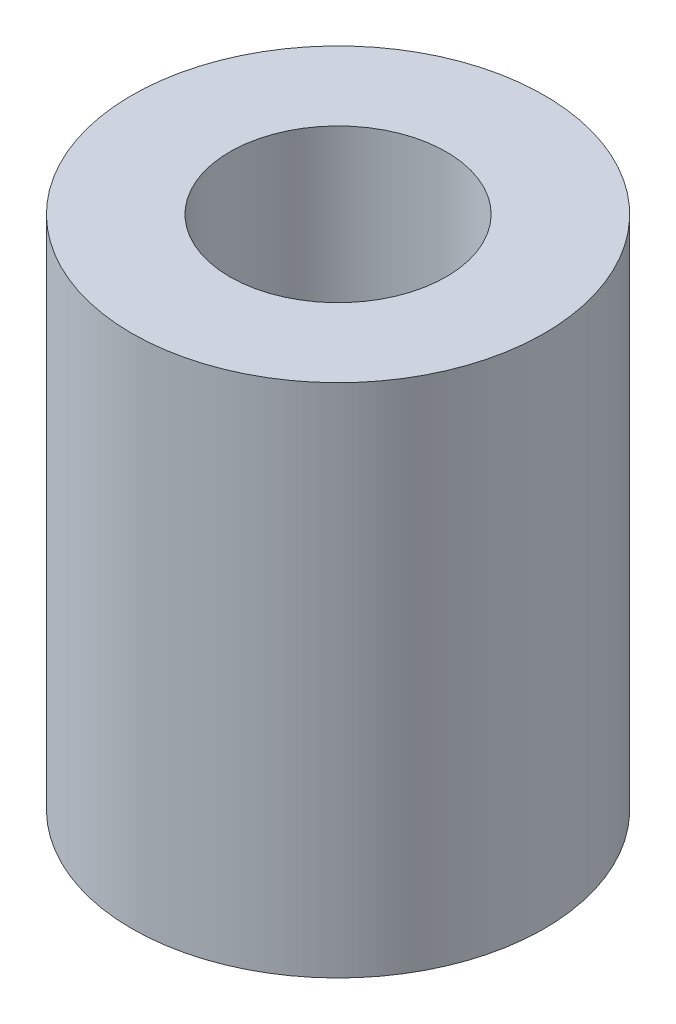
ISO-10303-21;
HEADER;
FILE_DESCRIPTION(('STEP AP214'),'2;1');
FILE_NAME('part.step','',(''),(''),'','','');
FILE_SCHEMA(('AUTOMOTIVE_DESIGN { 1 0 10303 214 1 1 1 1 }'));
ENDSEC;
DATA;
#1=APPLICATION_CONTEXT('core data for automotive mechanical design processes');
#2=APPLICATION_PROTOCOL_DEFINITION('international standard','automotive_design',2000,#1);
#3=PRODUCT_CONTEXT('',#1,'mechanical');
#4=PRODUCT('Part','Part','',(#3));
#5=PRODUCT_RELATED_PRODUCT_CATEGORY('part','',(#4));
#6=PRODUCT_DEFINITION_FORMATION('','',#4);
#7=PRODUCT_DEFINITION_CONTEXT('part definition',#1,'design');
#8=PRODUCT_DEFINITION('design','',#6,#7);
#9=PRODUCT_DEFINITION_SHAPE('','',#8);
#10=(LENGTH_UNIT() NAMED_UNIT(*) SI_UNIT(.MILLI.,.METRE.));
#11=(NAMED_UNIT(*) PLANE_ANGLE_UNIT() SI_UNIT($,.RADIAN.));
#12=(NAMED_UNIT(*) SI_UNIT($,.STERADIAN.) SOLID_ANGLE_UNIT());
#13=UNCERTAINTY_MEASURE_WITH_UNIT(LENGTH_MEASURE(1.E-05),#10,'distance_accuracy_value','');
#14=(GEOMETRIC_REPRESENTATION_CONTEXT(3) GLOBAL_UNCERTAINTY_ASSIGNED_CONTEXT((#13)) GLOBAL_UNIT_ASSIGNED_CONTEXT((#10,
#11,#12)) REPRESENTATION_CONTEXT('',''));
#15=CARTESIAN_POINT('',(0.,0.,0.));
#16=DIRECTION('',(0.,0.,1.));
#17=DIRECTION('',(1.,0.,0.));
#18=AXIS2_PLACEMENT_3D('',#15,#16,#17);
#19=CARTESIAN_POINT('',(0.,10.,0.));
#20=DIRECTION('',(0.,1.,0.));
#21=DIRECTION('',(0.,0.,1.));
#22=AXIS2_PLACEMENT_3D('',#19,#20,#21);
#23=PLANE('',#22);
#24=CARTESIAN_POINT('',(0.,10.,0.));
#25=DIRECTION('',(0.,1.,0.));
#26=DIRECTION('',(0.,0.,1.));
#27=AXIS2_PLACEMENT_3D('',#24,#25,#26);
#28=CIRCLE('',#27,4.);
#29=CARTESIAN_POINT('',(0.,10.,4.));
#30=VERTEX_POINT('',#29);
#31=EDGE_CURVE('E10',#30,#30,#28,.T.);
#32=ORIENTED_EDGE('',*,*,#31,.T.);
#33=EDGE_LOOP('',(#32));
#34=FACE_BOUND('',#33,.T.);
#35=CARTESIAN_POINT('',(0.,10.,0.));
#36=DIRECTION('',(0.,1.,0.));
#37=DIRECTION('',(0.,0.,1.));
#38=AXIS2_PLACEMENT_3D('',#35,#36,#37);
#39=CIRCLE('',#38,2.1);
#40=CARTESIAN_POINT('',(0.,10.,2.1));
#41=VERTEX_POINT('',#40);
#42=EDGE_CURVE('E42',#41,#41,#39,.T.);
#43=ORIENTED_EDGE('',*,*,#42,.F.);
#44=EDGE_LOOP('',(#43));
#45=FACE_BOUND('',#44,.T.);
#46=ADVANCED_FACE('F31',(#34,#45),#23,.T.);
#47=CARTESIAN_POINT('',(0.,0.,0.));
#48=DIRECTION('',(0.,1.,0.));
#49=DIRECTION('',(0.,0.,1.));
#50=AXIS2_PLACEMENT_3D('',#47,#48,#49);
#51=PLANE('',#50);
#52=CARTESIAN_POINT('',(0.,0.,0.));
#53=DIRECTION('',(0.,1.,0.));
#54=DIRECTION('',(0.,0.,1.));
#55=AXIS2_PLACEMENT_3D('',#52,#53,#54);
#56=CIRCLE('',#55,4.);
#57=CARTESIAN_POINT('',(0.,0.,4.));
#58=VERTEX_POINT('',#57);
#59=EDGE_CURVE('E35',#58,#58,#56,.T.);
#60=ORIENTED_EDGE('',*,*,#59,.F.);
#61=EDGE_LOOP('',(#60));
#62=FACE_BOUND('',#61,.T.);
#63=CARTESIAN_POINT('',(0.,0.,0.));
#64=DIRECTION('',(0.,1.,0.));
#65=DIRECTION('',(0.,0.,1.));
#66=AXIS2_PLACEMENT_3D('',#63,#64,#65);
#67=CIRCLE('',#66,2.1);
#68=CARTESIAN_POINT('',(0.,0.,2.1));
#69=VERTEX_POINT('',#68);
#70=EDGE_CURVE('E44',#69,#69,#67,.T.);
#71=ORIENTED_EDGE('',*,*,#70,.T.);
#72=EDGE_LOOP('',(#71));
#73=FACE_BOUND('',#72,.T.);
#74=ADVANCED_FACE('F54',(#62,#73),#51,.F.);
#75=CARTESIAN_POINT('',(0.,10.,0.));
#76=DIRECTION('',(0.,-1.,0.));
#77=DIRECTION('',(0.,0.,-1.));
#78=AXIS2_PLACEMENT_3D('',#75,#76,#77);
#79=CYLINDRICAL_SURFACE('',#78,4.);
#80=ORIENTED_EDGE('',*,*,#31,.F.);
#81=EDGE_LOOP('',(#80));
#82=FACE_BOUND('',#81,.T.);
#83=ORIENTED_EDGE('',*,*,#59,.T.);
#84=EDGE_LOOP('',(#83));
#85=FACE_BOUND('',#84,.T.);
#86=ADVANCED_FACE('F33',(#82,#85),#79,.T.);
#87=CARTESIAN_POINT('',(0.,10.,0.));
#88=DIRECTION('',(0.,-1.,0.));
#89=DIRECTION('',(0.,0.,-1.));
#90=AXIS2_PLACEMENT_3D('',#87,#88,#89);
#91=CYLINDRICAL_SURFACE('',#90,2.1);
#92=ORIENTED_EDGE('',*,*,#42,.T.);
#93=EDGE_LOOP('',(#92));
#94=FACE_BOUND('',#93,.T.);
#95=ORIENTED_EDGE('',*,*,#70,.F.);
#96=EDGE_LOOP('',(#95));
#97=FACE_BOUND('',#96,.T.);
#98=ADVANCED_FACE('F50',(#94,#97),#91,.F.);
#99=CLOSED_SHELL('',(#46,#74,#86,#98));
#100=MANIFOLD_SOLID_BREP('B2',#99);
#101=ADVANCED_BREP_SHAPE_REPRESENTATION('',(#18,#100),#14);
#102=SHAPE_DEFINITION_REPRESENTATION(#9,#101);
ENDSEC;
END-ISO-10303-21;
